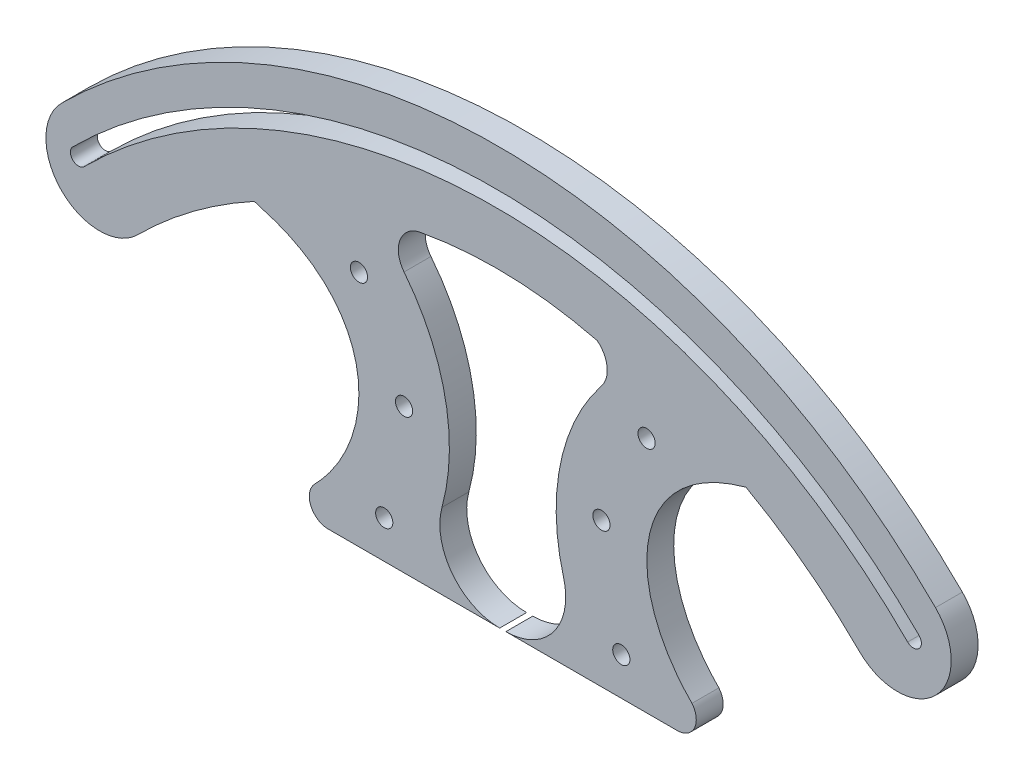
ISO-10303-21;
HEADER;
FILE_DESCRIPTION(('STEP AP214'),'2;1');
FILE_NAME('part.step','',(''),(''),'','','');
FILE_SCHEMA(('AUTOMOTIVE_DESIGN { 1 0 10303 214 1 1 1 1 }'));
ENDSEC;
DATA;
#1=APPLICATION_CONTEXT('core data for automotive mechanical design processes');
#2=APPLICATION_PROTOCOL_DEFINITION('international standard','automotive_design',2000,#1);
#3=PRODUCT_CONTEXT('',#1,'mechanical');
#4=PRODUCT('Part','Part','',(#3));
#5=PRODUCT_RELATED_PRODUCT_CATEGORY('part','',(#4));
#6=PRODUCT_DEFINITION_FORMATION('','',#4);
#7=PRODUCT_DEFINITION_CONTEXT('part definition',#1,'design');
#8=PRODUCT_DEFINITION('design','',#6,#7);
#9=PRODUCT_DEFINITION_SHAPE('','',#8);
#10=(LENGTH_UNIT() NAMED_UNIT(*) SI_UNIT(.MILLI.,.METRE.));
#11=(NAMED_UNIT(*) PLANE_ANGLE_UNIT() SI_UNIT($,.RADIAN.));
#12=(NAMED_UNIT(*) SI_UNIT($,.STERADIAN.) SOLID_ANGLE_UNIT());
#13=UNCERTAINTY_MEASURE_WITH_UNIT(LENGTH_MEASURE(1.E-05),#10,'distance_accuracy_value','');
#14=(GEOMETRIC_REPRESENTATION_CONTEXT(3) GLOBAL_UNCERTAINTY_ASSIGNED_CONTEXT((#13)) GLOBAL_UNIT_ASSIGNED_CONTEXT((#10,
#11,#12)) REPRESENTATION_CONTEXT('',''));
#15=CARTESIAN_POINT('',(0.,0.,0.));
#16=DIRECTION('',(0.,0.,1.));
#17=DIRECTION('',(1.,0.,0.));
#18=AXIS2_PLACEMENT_3D('',#15,#16,#17);
#19=CARTESIAN_POINT('',(-78.941928064493,66.2145491766591,5.));
#20=DIRECTION('',(0.,0.,-1.));
#21=DIRECTION('',(-1.,0.,0.));
#22=AXIS2_PLACEMENT_3D('',#19,#20,#21);
#23=CYLINDRICAL_SURFACE('',#22,1.49999999999999);
#24=CARTESIAN_POINT('',(-78.941928064493,66.2145491766591,0.));
#25=DIRECTION('',(0.,0.,1.));
#26=DIRECTION('',(1.,0.,0.));
#27=AXIS2_PLACEMENT_3D('',#24,#25,#26);
#28=CIRCLE('',#27,1.49999999999999);
#29=CARTESIAN_POINT('',(-80.0025882362729,67.2752093484389,0.));
#30=VERTEX_POINT('',#29);
#31=CARTESIAN_POINT('',(-77.8812678927132,65.1538890048793,0.));
#32=VERTEX_POINT('',#31);
#33=EDGE_CURVE('E302',#30,#32,#28,.T.);
#34=ORIENTED_EDGE('',*,*,#33,.F.);
#35=DIRECTION('',(0.,0.,-1.));
#36=VECTOR('',#35,1.);
#37=CARTESIAN_POINT('',(-80.0025882362729,67.2752093484389,5.));
#38=LINE('',#37,#36);
#39=CARTESIAN_POINT('',(-80.0025882362729,67.2752093484389,5.));
#40=VERTEX_POINT('',#39);
#41=EDGE_CURVE('E11',#40,#30,#38,.T.);
#42=ORIENTED_EDGE('',*,*,#41,.F.);
#43=CARTESIAN_POINT('',(-78.941928064493,66.2145491766591,5.));
#44=DIRECTION('',(0.,0.,1.));
#45=DIRECTION('',(1.,0.,0.));
#46=AXIS2_PLACEMENT_3D('',#43,#44,#45);
#47=CIRCLE('',#46,1.49999999999999);
#48=CARTESIAN_POINT('',(-77.8812678927132,65.1538890048793,5.));
#49=VERTEX_POINT('',#48);
#50=EDGE_CURVE('E214',#40,#49,#47,.T.);
#51=ORIENTED_EDGE('',*,*,#50,.T.);
#52=DIRECTION('',(0.,0.,-1.));
#53=VECTOR('',#52,1.);
#54=CARTESIAN_POINT('',(-77.8812678927132,65.1538890048793,5.));
#55=LINE('',#54,#53);
#56=EDGE_CURVE('E133',#49,#32,#55,.T.);
#57=ORIENTED_EDGE('',*,*,#56,.T.);
#58=EDGE_LOOP('',(#34,#42,#51,#57));
#59=FACE_BOUND('',#58,.T.);
#60=ADVANCED_FACE('F35',(#59),#23,.F.);
#61=CARTESIAN_POINT('',(-1.2789137930092,-11.4484650948247,5.));
#62=DIRECTION('',(0.,0.,-1.));
#63=DIRECTION('',(-1.,0.,0.));
#64=AXIS2_PLACEMENT_3D('',#61,#62,#63);
#65=CYLINDRICAL_SURFACE('',#64,111.332088077508);
#66=CARTESIAN_POINT('',(-1.2789137930092,-11.4484650948247,0.));
#67=DIRECTION('',(0.,0.,1.));
#68=DIRECTION('',(1.,0.,0.));
#69=AXIS2_PLACEMENT_3D('',#66,#67,#68);
#70=CIRCLE('',#69,111.332088077508);
#71=CARTESIAN_POINT('',(77.4447606502544,67.2752093484389,0.));
#72=VERTEX_POINT('',#71);
#73=EDGE_CURVE('E205',#72,#30,#70,.T.);
#74=ORIENTED_EDGE('',*,*,#73,.F.);
#75=DIRECTION('',(0.,0.,-1.));
#76=VECTOR('',#75,1.);
#77=CARTESIAN_POINT('',(77.4447606502544,67.2752093484389,5.));
#78=LINE('',#77,#76);
#79=CARTESIAN_POINT('',(77.4447606502544,67.2752093484389,5.));
#80=VERTEX_POINT('',#79);
#81=EDGE_CURVE('E45',#80,#72,#78,.T.);
#82=ORIENTED_EDGE('',*,*,#81,.F.);
#83=CARTESIAN_POINT('',(-1.2789137930092,-11.4484650948247,5.));
#84=DIRECTION('',(0.,0.,1.));
#85=DIRECTION('',(1.,0.,0.));
#86=AXIS2_PLACEMENT_3D('',#83,#84,#85);
#87=CIRCLE('',#86,111.332088077508);
#88=EDGE_CURVE('E203',#80,#40,#87,.T.);
#89=ORIENTED_EDGE('',*,*,#88,.T.);
#90=ORIENTED_EDGE('',*,*,#41,.T.);
#91=EDGE_LOOP('',(#74,#82,#89,#90));
#92=FACE_BOUND('',#91,.T.);
#93=ADVANCED_FACE('F202',(#92),#65,.F.);
#94=CARTESIAN_POINT('',(76.3841004784746,66.2145491766591,5.));
#95=DIRECTION('',(0.,0.,-1.));
#96=DIRECTION('',(-1.,0.,0.));
#97=AXIS2_PLACEMENT_3D('',#94,#95,#96);
#98=CYLINDRICAL_SURFACE('',#97,1.5);
#99=CARTESIAN_POINT('',(76.3841004784746,66.2145491766591,0.));
#100=DIRECTION('',(0.,0.,1.));
#101=DIRECTION('',(1.,0.,0.));
#102=AXIS2_PLACEMENT_3D('',#99,#100,#101);
#103=CIRCLE('',#102,1.5);
#104=CARTESIAN_POINT('',(75.3234403066948,65.1538890048793,0.));
#105=VERTEX_POINT('',#104);
#106=EDGE_CURVE('E306',#105,#72,#103,.T.);
#107=ORIENTED_EDGE('',*,*,#106,.F.);
#108=DIRECTION('',(0.,0.,-1.));
#109=VECTOR('',#108,1.);
#110=CARTESIAN_POINT('',(75.3234403066948,65.1538890048793,5.));
#111=LINE('',#110,#109);
#112=CARTESIAN_POINT('',(75.3234403066948,65.1538890048793,5.));
#113=VERTEX_POINT('',#112);
#114=EDGE_CURVE('E126',#113,#105,#111,.T.);
#115=ORIENTED_EDGE('',*,*,#114,.F.);
#116=CARTESIAN_POINT('',(76.3841004784746,66.2145491766591,5.));
#117=DIRECTION('',(0.,0.,1.));
#118=DIRECTION('',(1.,0.,0.));
#119=AXIS2_PLACEMENT_3D('',#116,#117,#118);
#120=CIRCLE('',#119,1.5);
#121=EDGE_CURVE('E213',#113,#80,#120,.T.);
#122=ORIENTED_EDGE('',*,*,#121,.T.);
#123=ORIENTED_EDGE('',*,*,#81,.T.);
#124=EDGE_LOOP('',(#107,#115,#122,#123));
#125=FACE_BOUND('',#124,.T.);
#126=ADVANCED_FACE('F216',(#125),#98,.F.);
#127=CARTESIAN_POINT('',(17.549793049826,55.0367014000985,5.));
#128=DIRECTION('',(-0.303802750093949,-0.952734952143225,0.));
#129=DIRECTION('',(0.952734952143225,-0.303802750093949,0.));
#130=AXIS2_PLACEMENT_3D('',#127,#128,#129);
#131=PLANE('',#130);
#132=DIRECTION('',(-0.952734952143225,0.303802750093949,0.));
#133=VECTOR('',#132,1.);
#134=CARTESIAN_POINT('',(17.549793049826,55.0367014000985,0.));
#135=LINE('',#134,#133);
#136=CARTESIAN_POINT('',(-45.0557374475651,75.,0.));
#137=VERTEX_POINT('',#136);
#138=CARTESIAN_POINT('',(-46.2299272100906,75.3744190114836,0.));
#139=VERTEX_POINT('',#138);
#140=EDGE_CURVE('E240',#137,#139,#135,.T.);
#141=ORIENTED_EDGE('',*,*,#140,.F.);
#142=DIRECTION('',(0.,0.,-1.));
#143=VECTOR('',#142,1.);
#144=CARTESIAN_POINT('',(-45.0557374475651,75.,5.));
#145=LINE('',#144,#143);
#146=CARTESIAN_POINT('',(-45.0557374475651,75.,5.));
#147=VERTEX_POINT('',#146);
#148=EDGE_CURVE('E39',#147,#137,#145,.T.);
#149=ORIENTED_EDGE('',*,*,#148,.F.);
#150=DIRECTION('',(-0.952734952143225,0.303802750093949,0.));
#151=VECTOR('',#150,1.);
#152=CARTESIAN_POINT('',(17.549793049826,55.0367014000985,5.));
#153=LINE('',#152,#151);
#154=CARTESIAN_POINT('',(-46.2299272100906,75.3744190114836,5.));
#155=VERTEX_POINT('',#154);
#156=EDGE_CURVE('E328',#147,#155,#153,.T.);
#157=ORIENTED_EDGE('',*,*,#156,.T.);
#158=DIRECTION('',(0.,0.,-1.));
#159=VECTOR('',#158,1.);
#160=CARTESIAN_POINT('',(-46.2299272100906,75.3744190114836,5.));
#161=LINE('',#160,#159);
#162=EDGE_CURVE('E239',#155,#139,#161,.T.);
#163=ORIENTED_EDGE('',*,*,#162,.T.);
#164=EDGE_LOOP('',(#141,#149,#157,#163));
#165=FACE_BOUND('',#164,.T.);
#166=ADVANCED_FACE('F37',(#165),#131,.T.);
#167=CARTESIAN_POINT('',(-45.0557374475651,75.,5.));
#168=CARTESIAN_POINT('',(-29.9457482812626,70.8924992288879,5.));
#169=CARTESIAN_POINT('',(-22.5994925533222,54.7742296366952,5.));
#170=CARTESIAN_POINT('',(-31.1258499826614,39.4112712545638,5.));
#171=CARTESIAN_POINT('',(-35.0019822048694,35.4282458126308,5.));
#172=B_SPLINE_CURVE_WITH_KNOTS('',3,(#167,#168,#169,#170,#171),.UNSPECIFIED.,.F.,.F.,(4,1,4),
(0.154808761441348,0.468621414690025,0.606167070491541),.UNSPECIFIED.);
#173=DIRECTION('',(0.,0.,-1.));
#174=VECTOR('',#173,1.);
#175=SURFACE_OF_LINEAR_EXTRUSION('',#172,#174);
#176=CARTESIAN_POINT('',(-45.0557374475651,75.,0.));
#177=CARTESIAN_POINT('',(-29.9457482812626,70.8924992288879,0.));
#178=CARTESIAN_POINT('',(-22.5994925533222,54.7742296366952,0.));
#179=CARTESIAN_POINT('',(-31.1258499826614,39.4112712545638,0.));
#180=CARTESIAN_POINT('',(-35.0019822048694,35.4282458126308,0.));
#181=B_SPLINE_CURVE_WITH_KNOTS('',3,(#176,#177,#178,#179,#180),.UNSPECIFIED.,.F.,.F.,(4,1,4),
(0.154808761441348,0.468621414690025,0.606167070491541),.UNSPECIFIED.);
#182=CARTESIAN_POINT('',(-35.0019822048694,35.4282458126308,0.));
#183=VERTEX_POINT('',#182);
#184=EDGE_CURVE('E243',#137,#183,#181,.T.);
#185=ORIENTED_EDGE('',*,*,#184,.T.);
#186=DIRECTION('',(0.,0.,-1.));
#187=VECTOR('',#186,1.);
#188=CARTESIAN_POINT('',(-35.0019822048694,35.4282458126308,5.));
#189=LINE('',#188,#187);
#190=CARTESIAN_POINT('',(-35.0019822048694,35.4282458126308,5.));
#191=VERTEX_POINT('',#190);
#192=EDGE_CURVE('E368',#191,#183,#189,.T.);
#193=ORIENTED_EDGE('',*,*,#192,.F.);
#194=EDGE_CURVE('E376',#147,#191,#172,.T.);
#195=ORIENTED_EDGE('',*,*,#194,.F.);
#196=ORIENTED_EDGE('',*,*,#148,.T.);
#197=EDGE_LOOP('',(#185,#193,#195,#196));
#198=FACE_BOUND('',#197,.T.);
#199=ADVANCED_FACE('F375',(#198),#175,.F.);
#200=CARTESIAN_POINT('',(-32.4790033651743,32.9729766412289,5.));
#201=DIRECTION('',(0.,0.,-1.));
#202=DIRECTION('',(-1.,0.,0.));
#203=AXIS2_PLACEMENT_3D('',#200,#201,#202);
#204=CYLINDRICAL_SURFACE('',#203,3.52047850861017);
#205=CARTESIAN_POINT('',(-32.4790033651743,32.9729766412289,0.));
#206=DIRECTION('',(0.,0.,1.));
#207=DIRECTION('',(1.,0.,0.));
#208=AXIS2_PLACEMENT_3D('',#205,#206,#207);
#209=CIRCLE('',#208,3.52047850861017);
#210=CARTESIAN_POINT('',(-32.4790033651742,29.4524981326187,0.));
#211=VERTEX_POINT('',#210);
#212=EDGE_CURVE('E248',#211,#183,#209,.F.);
#213=ORIENTED_EDGE('',*,*,#212,.F.);
#214=DIRECTION('',(0.,0.,-1.));
#215=VECTOR('',#214,1.);
#216=CARTESIAN_POINT('',(-32.4790033651742,29.4524981326187,5.));
#217=LINE('',#216,#215);
#218=CARTESIAN_POINT('',(-32.4790033651742,29.4524981326187,5.));
#219=VERTEX_POINT('',#218);
#220=EDGE_CURVE('E367',#219,#211,#217,.T.);
#221=ORIENTED_EDGE('',*,*,#220,.F.);
#222=CARTESIAN_POINT('',(-32.4790033651743,32.9729766412289,5.));
#223=DIRECTION('',(0.,0.,1.));
#224=DIRECTION('',(1.,0.,0.));
#225=AXIS2_PLACEMENT_3D('',#222,#223,#224);
#226=CIRCLE('',#225,3.52047850861017);
#227=EDGE_CURVE('E748',#219,#191,#226,.F.);
#228=ORIENTED_EDGE('',*,*,#227,.T.);
#229=ORIENTED_EDGE('',*,*,#192,.T.);
#230=EDGE_LOOP('',(#213,#221,#228,#229));
#231=FACE_BOUND('',#230,.T.);
#232=ADVANCED_FACE('F476',(#231),#204,.T.);
#233=CARTESIAN_POINT('',(0.,29.4524981326187,5.));
#234=DIRECTION('',(0.,-1.,0.));
#235=DIRECTION('',(1.,0.,0.));
#236=AXIS2_PLACEMENT_3D('',#233,#234,#235);
#237=PLANE('',#236);
#238=DIRECTION('',(-1.,0.,0.));
#239=VECTOR('',#238,1.);
#240=CARTESIAN_POINT('',(0.,29.4524981326187,0.));
#241=LINE('',#240,#239);
#242=CARTESIAN_POINT('',(-0.573242193932219,29.4524981326187,0.));
#243=VERTEX_POINT('',#242);
#244=EDGE_CURVE('E254',#243,#211,#241,.T.);
#245=ORIENTED_EDGE('',*,*,#244,.F.);
#246=DIRECTION('',(0.,0.,-1.));
#247=VECTOR('',#246,1.);
#248=CARTESIAN_POINT('',(-0.573242193932219,29.4524981326187,5.));
#249=LINE('',#248,#247);
#250=CARTESIAN_POINT('',(-0.573242193932219,29.4524981326187,5.));
#251=VERTEX_POINT('',#250);
#252=EDGE_CURVE('E365',#251,#243,#249,.T.);
#253=ORIENTED_EDGE('',*,*,#252,.F.);
#254=DIRECTION('',(-1.,0.,0.));
#255=VECTOR('',#254,1.);
#256=CARTESIAN_POINT('',(0.,29.4524981326187,5.));
#257=LINE('',#256,#255);
#258=EDGE_CURVE('E474',#251,#219,#257,.T.);
#259=ORIENTED_EDGE('',*,*,#258,.T.);
#260=ORIENTED_EDGE('',*,*,#220,.T.);
#261=EDGE_LOOP('',(#245,#253,#259,#260));
#262=FACE_BOUND('',#261,.T.);
#263=ADVANCED_FACE('F472',(#262),#237,.T.);
#264=CARTESIAN_POINT('',(-0.573242193932219,40.5887460175978,5.));
#265=DIRECTION('',(0.,0.,-1.));
#266=DIRECTION('',(-1.,0.,0.));
#267=AXIS2_PLACEMENT_3D('',#264,#265,#266);
#268=CYLINDRICAL_SURFACE('',#267,11.1362478849791);
#269=CARTESIAN_POINT('',(-0.573242193932219,40.5887460175978,0.));
#270=DIRECTION('',(0.,0.,1.));
#271=DIRECTION('',(1.,0.,0.));
#272=AXIS2_PLACEMENT_3D('',#269,#270,#271);
#273=CIRCLE('',#272,11.1362478849791);
#274=CARTESIAN_POINT('',(-11.3130557503206,43.5336435930185,0.));
#275=VERTEX_POINT('',#274);
#276=EDGE_CURVE('E257',#243,#275,#273,.F.);
#277=ORIENTED_EDGE('',*,*,#276,.T.);
#278=DIRECTION('',(0.,0.,-1.));
#279=VECTOR('',#278,1.);
#280=CARTESIAN_POINT('',(-11.3130557503206,43.5336435930185,5.));
#281=LINE('',#280,#279);
#282=CARTESIAN_POINT('',(-11.3130557503206,43.5336435930185,5.));
#283=VERTEX_POINT('',#282);
#284=EDGE_CURVE('E362',#283,#275,#281,.T.);
#285=ORIENTED_EDGE('',*,*,#284,.F.);
#286=CARTESIAN_POINT('',(-0.573242193932219,40.5887460175978,5.));
#287=DIRECTION('',(0.,0.,1.));
#288=DIRECTION('',(1.,0.,0.));
#289=AXIS2_PLACEMENT_3D('',#286,#287,#288);
#290=CIRCLE('',#289,11.1362478849791);
#291=EDGE_CURVE('E468',#251,#283,#290,.F.);
#292=ORIENTED_EDGE('',*,*,#291,.F.);
#293=ORIENTED_EDGE('',*,*,#252,.T.);
#294=EDGE_LOOP('',(#277,#285,#292,#293));
#295=FACE_BOUND('',#294,.T.);
#296=ADVANCED_FACE('F467',(#295),#268,.F.);
#297=CARTESIAN_POINT('',(-48.7100144691619,53.7880313885788,5.));
#298=DIRECTION('',(0.,0.,-1.));
#299=DIRECTION('',(-1.,0.,0.));
#300=AXIS2_PLACEMENT_3D('',#297,#298,#299);
#301=CYLINDRICAL_SURFACE('',#300,38.7773773027581);
#302=CARTESIAN_POINT('',(-48.7100144691619,53.7880313885788,0.));
#303=DIRECTION('',(0.,0.,1.));
#304=DIRECTION('',(1.,0.,0.));
#305=AXIS2_PLACEMENT_3D('',#302,#303,#304);
#306=CIRCLE('',#305,38.7773773027581);
#307=CARTESIAN_POINT('',(-18.3640575271982,77.9294457580176,0.));
#308=VERTEX_POINT('',#307);
#309=EDGE_CURVE('E259',#275,#308,#306,.T.);
#310=ORIENTED_EDGE('',*,*,#309,.T.);
#311=DIRECTION('',(0.,0.,-1.));
#312=VECTOR('',#311,1.);
#313=CARTESIAN_POINT('',(-18.3640575271982,77.9294457580176,5.));
#314=LINE('',#313,#312);
#315=CARTESIAN_POINT('',(-18.3640575271982,77.9294457580176,5.));
#316=VERTEX_POINT('',#315);
#317=EDGE_CURVE('E360',#316,#308,#314,.T.);
#318=ORIENTED_EDGE('',*,*,#317,.F.);
#319=CARTESIAN_POINT('',(-48.7100144691619,53.7880313885788,5.));
#320=DIRECTION('',(0.,0.,1.));
#321=DIRECTION('',(1.,0.,0.));
#322=AXIS2_PLACEMENT_3D('',#319,#320,#321);
#323=CIRCLE('',#322,38.7773773027581);
#324=EDGE_CURVE('E464',#283,#316,#323,.T.);
#325=ORIENTED_EDGE('',*,*,#324,.F.);
#326=ORIENTED_EDGE('',*,*,#284,.T.);
#327=EDGE_LOOP('',(#310,#318,#325,#326));
#328=FACE_BOUND('',#327,.T.);
#329=ADVANCED_FACE('F462',(#328),#301,.T.);
#330=CARTESIAN_POINT('',(-14.5190064202318,80.9883366746057,5.));
#331=DIRECTION('',(0.,0.,-1.));
#332=DIRECTION('',(-1.,0.,0.));
#333=AXIS2_PLACEMENT_3D('',#330,#331,#332);
#334=CYLINDRICAL_SURFACE('',#333,4.91337273721105);
#335=CARTESIAN_POINT('',(-14.5190064202318,80.9883366746057,0.));
#336=DIRECTION('',(0.,0.,1.));
#337=DIRECTION('',(1.,0.,0.));
#338=AXIS2_PLACEMENT_3D('',#335,#336,#337);
#339=CIRCLE('',#338,4.91337273721105);
#340=CARTESIAN_POINT('',(-15.2684143703002,85.8442216999273,0.));
#341=VERTEX_POINT('',#340);
#342=EDGE_CURVE('E262',#341,#308,#339,.T.);
#343=ORIENTED_EDGE('',*,*,#342,.F.);
#344=DIRECTION('',(0.,0.,-1.));
#345=VECTOR('',#344,1.);
#346=CARTESIAN_POINT('',(-15.2684143703002,85.8442216999273,5.));
#347=LINE('',#346,#345);
#348=CARTESIAN_POINT('',(-15.2684143703002,85.8442216999273,5.));
#349=VERTEX_POINT('',#348);
#350=EDGE_CURVE('E358',#349,#341,#347,.T.);
#351=ORIENTED_EDGE('',*,*,#350,.F.);
#352=CARTESIAN_POINT('',(-14.5190064202318,80.9883366746057,5.));
#353=DIRECTION('',(0.,0.,1.));
#354=DIRECTION('',(1.,0.,0.));
#355=AXIS2_PLACEMENT_3D('',#352,#353,#354);
#356=CIRCLE('',#355,4.91337273721105);
#357=EDGE_CURVE('E459',#349,#316,#356,.T.);
#358=ORIENTED_EDGE('',*,*,#357,.T.);
#359=ORIENTED_EDGE('',*,*,#317,.T.);
#360=EDGE_LOOP('',(#343,#351,#358,#359));
#361=FACE_BOUND('',#360,.T.);
#362=ADVANCED_FACE('F455',(#361),#334,.F.);
#363=CARTESIAN_POINT('',(-1.15465798018424,9.62516806624939,5.));
#364=DIRECTION('',(0.,0.,-1.));
#365=DIRECTION('',(-1.,0.,0.));
#366=AXIS2_PLACEMENT_3D('',#363,#364,#365);
#367=CYLINDRICAL_SURFACE('',#366,77.5147873392749);
#368=CARTESIAN_POINT('',(-1.15465798018424,9.62516806624939,0.));
#369=DIRECTION('',(0.,0.,1.));
#370=DIRECTION('',(1.,0.,0.));
#371=AXIS2_PLACEMENT_3D('',#368,#369,#370);
#372=CIRCLE('',#371,77.5147873392749);
#373=CARTESIAN_POINT('',(17.5612829912327,84.8465467415133,0.));
#374=VERTEX_POINT('',#373);
#375=EDGE_CURVE('E265',#374,#341,#372,.T.);
#376=ORIENTED_EDGE('',*,*,#375,.F.);
#377=DIRECTION('',(0.,0.,-1.));
#378=VECTOR('',#377,1.);
#379=CARTESIAN_POINT('',(17.5612829912327,84.8465467415133,5.));
#380=LINE('',#379,#378);
#381=CARTESIAN_POINT('',(17.5612829912327,84.8465467415133,5.));
#382=VERTEX_POINT('',#381);
#383=EDGE_CURVE('E356',#382,#374,#380,.T.);
#384=ORIENTED_EDGE('',*,*,#383,.F.);
#385=CARTESIAN_POINT('',(-1.15465798018424,9.62516806624939,5.));
#386=DIRECTION('',(0.,0.,1.));
#387=DIRECTION('',(1.,0.,0.));
#388=AXIS2_PLACEMENT_3D('',#385,#386,#387);
#389=CIRCLE('',#388,77.5147873392749);
#390=EDGE_CURVE('E450',#382,#349,#389,.T.);
#391=ORIENTED_EDGE('',*,*,#390,.T.);
#392=ORIENTED_EDGE('',*,*,#350,.T.);
#393=EDGE_LOOP('',(#376,#384,#391,#392));
#394=FACE_BOUND('',#393,.T.);
#395=ADVANCED_FACE('F449',(#394),#367,.F.);
#396=CARTESIAN_POINT('',(14.5190064202449,80.9883366746057,5.));
#397=DIRECTION('',(0.,0.,-1.));
#398=DIRECTION('',(-1.,0.,0.));
#399=AXIS2_PLACEMENT_3D('',#396,#397,#398);
#400=CYLINDRICAL_SURFACE('',#399,4.91337273721105);
#401=CARTESIAN_POINT('',(14.5190064202449,80.9883366746057,0.));
#402=DIRECTION('',(0.,0.,1.));
#403=DIRECTION('',(1.,0.,0.));
#404=AXIS2_PLACEMENT_3D('',#401,#402,#403);
#405=CIRCLE('',#404,4.91337273721105);
#406=CARTESIAN_POINT('',(18.3640575272114,77.9294457580176,0.));
#407=VERTEX_POINT('',#406);
#408=EDGE_CURVE('E268',#374,#407,#405,.F.);
#409=ORIENTED_EDGE('',*,*,#408,.T.);
#410=DIRECTION('',(0.,0.,-1.));
#411=VECTOR('',#410,1.);
#412=CARTESIAN_POINT('',(18.3640575272114,77.9294457580176,5.));
#413=LINE('',#412,#411);
#414=CARTESIAN_POINT('',(18.3640575272114,77.9294457580176,5.));
#415=VERTEX_POINT('',#414);
#416=EDGE_CURVE('E354',#415,#407,#413,.T.);
#417=ORIENTED_EDGE('',*,*,#416,.F.);
#418=CARTESIAN_POINT('',(14.5190064202449,80.9883366746057,5.));
#419=DIRECTION('',(0.,0.,1.));
#420=DIRECTION('',(1.,0.,0.));
#421=AXIS2_PLACEMENT_3D('',#418,#419,#420);
#422=CIRCLE('',#421,4.91337273721105);
#423=EDGE_CURVE('E445',#382,#415,#422,.F.);
#424=ORIENTED_EDGE('',*,*,#423,.F.);
#425=ORIENTED_EDGE('',*,*,#383,.T.);
#426=EDGE_LOOP('',(#409,#417,#424,#425));
#427=FACE_BOUND('',#426,.T.);
#428=ADVANCED_FACE('F444',(#427),#400,.F.);
#429=CARTESIAN_POINT('',(48.710014469175,53.7880313885788,5.));
#430=DIRECTION('',(0.,0.,-1.));
#431=DIRECTION('',(-1.,0.,0.));
#432=AXIS2_PLACEMENT_3D('',#429,#430,#431);
#433=CYLINDRICAL_SURFACE('',#432,38.7773773027581);
#434=CARTESIAN_POINT('',(48.710014469175,53.7880313885788,0.));
#435=DIRECTION('',(0.,0.,1.));
#436=DIRECTION('',(1.,0.,0.));
#437=AXIS2_PLACEMENT_3D('',#434,#435,#436);
#438=CIRCLE('',#437,38.7773773027581);
#439=CARTESIAN_POINT('',(11.3130557503337,43.5336435930185,0.));
#440=VERTEX_POINT('',#439);
#441=EDGE_CURVE('E271',#440,#407,#438,.F.);
#442=ORIENTED_EDGE('',*,*,#441,.F.);
#443=DIRECTION('',(0.,0.,-1.));
#444=VECTOR('',#443,1.);
#445=CARTESIAN_POINT('',(11.3130557503337,43.5336435930185,5.));
#446=LINE('',#445,#444);
#447=CARTESIAN_POINT('',(11.3130557503337,43.5336435930185,5.));
#448=VERTEX_POINT('',#447);
#449=EDGE_CURVE('E352',#448,#440,#446,.T.);
#450=ORIENTED_EDGE('',*,*,#449,.F.);
#451=CARTESIAN_POINT('',(48.710014469175,53.7880313885788,5.));
#452=DIRECTION('',(0.,0.,1.));
#453=DIRECTION('',(1.,0.,0.));
#454=AXIS2_PLACEMENT_3D('',#451,#452,#453);
#455=CIRCLE('',#454,38.7773773027581);
#456=EDGE_CURVE('E441',#448,#415,#455,.F.);
#457=ORIENTED_EDGE('',*,*,#456,.T.);
#458=ORIENTED_EDGE('',*,*,#416,.T.);
#459=EDGE_LOOP('',(#442,#450,#457,#458));
#460=FACE_BOUND('',#459,.T.);
#461=ADVANCED_FACE('F437',(#460),#433,.T.);
#462=CARTESIAN_POINT('',(0.573242193945353,40.5887460175979,5.));
#463=DIRECTION('',(0.,0.,-1.));
#464=DIRECTION('',(-1.,0.,0.));
#465=AXIS2_PLACEMENT_3D('',#462,#463,#464);
#466=CYLINDRICAL_SURFACE('',#465,11.1362478849791);
#467=CARTESIAN_POINT('',(0.573242193945353,40.5887460175979,0.));
#468=DIRECTION('',(0.,0.,1.));
#469=DIRECTION('',(1.,0.,0.));
#470=AXIS2_PLACEMENT_3D('',#467,#468,#469);
#471=CIRCLE('',#470,11.1362478849791);
#472=CARTESIAN_POINT('',(0.573242193945381,29.4524981326187,0.));
#473=VERTEX_POINT('',#472);
#474=EDGE_CURVE('E274',#473,#440,#471,.T.);
#475=ORIENTED_EDGE('',*,*,#474,.F.);
#476=DIRECTION('',(0.,0.,-1.));
#477=VECTOR('',#476,1.);
#478=CARTESIAN_POINT('',(0.573242193945381,29.4524981326187,5.));
#479=LINE('',#478,#477);
#480=CARTESIAN_POINT('',(0.573242193945381,29.4524981326187,5.));
#481=VERTEX_POINT('',#480);
#482=EDGE_CURVE('E350',#481,#473,#479,.T.);
#483=ORIENTED_EDGE('',*,*,#482,.F.);
#484=CARTESIAN_POINT('',(0.573242193945353,40.5887460175979,5.));
#485=DIRECTION('',(0.,0.,1.));
#486=DIRECTION('',(1.,0.,0.));
#487=AXIS2_PLACEMENT_3D('',#484,#485,#486);
#488=CIRCLE('',#487,11.1362478849791);
#489=EDGE_CURVE('E432',#481,#448,#488,.T.);
#490=ORIENTED_EDGE('',*,*,#489,.T.);
#491=ORIENTED_EDGE('',*,*,#449,.T.);
#492=EDGE_LOOP('',(#475,#483,#490,#491));
#493=FACE_BOUND('',#492,.T.);
#494=ADVANCED_FACE('F431',(#493),#466,.F.);
#495=CARTESIAN_POINT('',(0.,29.4524981326187,5.));
#496=DIRECTION('',(0.,1.,0.));
#497=DIRECTION('',(-1.,0.,0.));
#498=AXIS2_PLACEMENT_3D('',#495,#496,#497);
#499=PLANE('',#498);
#500=DIRECTION('',(1.,0.,0.));
#501=VECTOR('',#500,1.);
#502=CARTESIAN_POINT('',(0.,29.4524981326187,0.));
#503=LINE('',#502,#501);
#504=CARTESIAN_POINT('',(32.4790033651873,29.4524981326188,0.));
#505=VERTEX_POINT('',#504);
#506=EDGE_CURVE('E277',#473,#505,#503,.T.);
#507=ORIENTED_EDGE('',*,*,#506,.T.);
#508=DIRECTION('',(0.,0.,-1.));
#509=VECTOR('',#508,1.);
#510=CARTESIAN_POINT('',(32.4790033651873,29.4524981326188,5.));
#511=LINE('',#510,#509);
#512=CARTESIAN_POINT('',(32.4790033651873,29.4524981326188,5.));
#513=VERTEX_POINT('',#512);
#514=EDGE_CURVE('E347',#513,#505,#511,.T.);
#515=ORIENTED_EDGE('',*,*,#514,.F.);
#516=DIRECTION('',(1.,0.,0.));
#517=VECTOR('',#516,1.);
#518=CARTESIAN_POINT('',(0.,29.4524981326187,5.));
#519=LINE('',#518,#517);
#520=EDGE_CURVE('E427',#481,#513,#519,.T.);
#521=ORIENTED_EDGE('',*,*,#520,.F.);
#522=ORIENTED_EDGE('',*,*,#482,.T.);
#523=EDGE_LOOP('',(#507,#515,#521,#522));
#524=FACE_BOUND('',#523,.T.);
#525=ADVANCED_FACE('F426',(#524),#499,.F.);
#526=CARTESIAN_POINT('',(32.4790033651873,32.972976641229,5.));
#527=DIRECTION('',(0.,0.,-1.));
#528=DIRECTION('',(-1.,0.,0.));
#529=AXIS2_PLACEMENT_3D('',#526,#527,#528);
#530=CYLINDRICAL_SURFACE('',#529,3.52047850861017);
#531=CARTESIAN_POINT('',(32.4790033651873,32.972976641229,0.));
#532=DIRECTION('',(0.,0.,1.));
#533=DIRECTION('',(1.,0.,0.));
#534=AXIS2_PLACEMENT_3D('',#531,#532,#533);
#535=CIRCLE('',#534,3.52047850861017);
#536=CARTESIAN_POINT('',(35.1967247175278,35.2107790410442,0.));
#537=VERTEX_POINT('',#536);
#538=EDGE_CURVE('E279',#505,#537,#535,.T.);
#539=ORIENTED_EDGE('',*,*,#538,.T.);
#540=DIRECTION('',(0.,0.,-1.));
#541=VECTOR('',#540,1.);
#542=CARTESIAN_POINT('',(35.1967247175278,35.2107790410442,5.));
#543=LINE('',#542,#541);
#544=CARTESIAN_POINT('',(35.1967247175278,35.2107790410442,5.));
#545=VERTEX_POINT('',#544);
#546=EDGE_CURVE('E345',#545,#537,#543,.T.);
#547=ORIENTED_EDGE('',*,*,#546,.F.);
#548=CARTESIAN_POINT('',(32.4790033651873,32.972976641229,5.));
#549=DIRECTION('',(0.,0.,1.));
#550=DIRECTION('',(1.,0.,0.));
#551=AXIS2_PLACEMENT_3D('',#548,#549,#550);
#552=CIRCLE('',#551,3.52047850861017);
#553=EDGE_CURVE('E423',#513,#545,#552,.T.);
#554=ORIENTED_EDGE('',*,*,#553,.F.);
#555=ORIENTED_EDGE('',*,*,#514,.T.);
#556=EDGE_LOOP('',(#539,#547,#554,#555));
#557=FACE_BOUND('',#556,.T.);
#558=ADVANCED_FACE('F420',(#557),#530,.T.);
#559=CARTESIAN_POINT('',(45.2420515641973,75.0539776502703,5.));
#560=CARTESIAN_POINT('',(30.1320623978949,70.9464768791582,5.));
#561=CARTESIAN_POINT('',(22.5400885489823,54.6807031963261,5.));
#562=CARTESIAN_POINT('',(31.1995080730502,39.2379341379593,5.));
#563=CARTESIAN_POINT('',(35.1967247175278,35.2107790410442,5.));
#564=B_SPLINE_CURVE_WITH_KNOTS('',3,(#559,#560,#561,#562,#563),.UNSPECIFIED.,.F.,.F.,(4,1,4),
(0.15480876144135,0.468621414690025,0.608629264667389),.UNSPECIFIED.);
#565=DIRECTION('',(0.,0.,-1.));
#566=VECTOR('',#565,1.);
#567=SURFACE_OF_LINEAR_EXTRUSION('',#564,#566);
#568=CARTESIAN_POINT('',(45.2420515641973,75.0539776502703,0.));
#569=CARTESIAN_POINT('',(30.1320623978949,70.9464768791582,0.));
#570=CARTESIAN_POINT('',(22.5400885489823,54.6807031963261,0.));
#571=CARTESIAN_POINT('',(31.1995080730502,39.2379341379593,0.));
#572=CARTESIAN_POINT('',(35.1967247175278,35.2107790410442,0.));
#573=B_SPLINE_CURVE_WITH_KNOTS('',3,(#568,#569,#570,#571,#572),.UNSPECIFIED.,.F.,.F.,(4,1,4),
(0.15480876144135,0.468621414690025,0.608629264667389),.UNSPECIFIED.);
#574=CARTESIAN_POINT('',(45.2420515641973,75.0539776502703,0.));
#575=VERTEX_POINT('',#574);
#576=EDGE_CURVE('E282',#575,#537,#573,.T.);
#577=ORIENTED_EDGE('',*,*,#576,.F.);
#578=DIRECTION('',(0.,0.,-1.));
#579=VECTOR('',#578,1.);
#580=CARTESIAN_POINT('',(45.2420515641973,75.0539776502703,5.));
#581=LINE('',#580,#579);
#582=CARTESIAN_POINT('',(45.2420515641973,75.0539776502703,5.));
#583=VERTEX_POINT('',#582);
#584=EDGE_CURVE('E343',#583,#575,#581,.T.);
#585=ORIENTED_EDGE('',*,*,#584,.F.);
#586=EDGE_CURVE('E509',#583,#545,#564,.T.);
#587=ORIENTED_EDGE('',*,*,#586,.T.);
#588=ORIENTED_EDGE('',*,*,#546,.T.);
#589=EDGE_LOOP('',(#577,#585,#587,#588));
#590=FACE_BOUND('',#589,.T.);
#591=ADVANCED_FACE('F414',(#590),#567,.T.);
#592=CARTESIAN_POINT('',(-0.785450823351054,-8.,5.));
#593=DIRECTION('',(0.,0.,-1.));
#594=DIRECTION('',(-1.,0.,0.));
#595=AXIS2_PLACEMENT_3D('',#592,#593,#594);
#596=CYLINDRICAL_SURFACE('',#595,94.9552219710289);
#597=CARTESIAN_POINT('',(-0.785450823351054,-8.,0.));
#598=DIRECTION('',(0.,0.,1.));
#599=DIRECTION('',(1.,0.,0.));
#600=AXIS2_PLACEMENT_3D('',#597,#598,#599);
#601=CIRCLE('',#600,94.9552219710289);
#602=CARTESIAN_POINT('',(66.3580305414326,59.1434813647931,0.));
#603=VERTEX_POINT('',#602);
#604=EDGE_CURVE('E287',#603,#575,#601,.T.);
#605=ORIENTED_EDGE('',*,*,#604,.F.);
#606=DIRECTION('',(0.,0.,-1.));
#607=VECTOR('',#606,1.);
#608=CARTESIAN_POINT('',(66.3580305414326,59.1434813647931,5.));
#609=LINE('',#608,#607);
#610=CARTESIAN_POINT('',(66.3580305414326,59.1434813647931,5.));
#611=VERTEX_POINT('',#610);
#612=EDGE_CURVE('E341',#611,#603,#609,.T.);
#613=ORIENTED_EDGE('',*,*,#612,.F.);
#614=CARTESIAN_POINT('',(-0.785450823351054,-8.,5.));
#615=DIRECTION('',(0.,0.,1.));
#616=DIRECTION('',(1.,0.,0.));
#617=AXIS2_PLACEMENT_3D('',#614,#615,#616);
#618=CIRCLE('',#617,94.9552219710289);
#619=EDGE_CURVE('E410',#611,#583,#618,.T.);
#620=ORIENTED_EDGE('',*,*,#619,.T.);
#621=ORIENTED_EDGE('',*,*,#584,.T.);
#622=EDGE_LOOP('',(#605,#613,#620,#621));
#623=FACE_BOUND('',#622,.T.);
#624=ADVANCED_FACE('F407',(#623),#596,.F.);
#625=CARTESIAN_POINT('',(73.4290983532976,66.2145491766591,5.));
#626=DIRECTION('',(0.,0.,-1.));
#627=DIRECTION('',(-1.,0.,0.));
#628=AXIS2_PLACEMENT_3D('',#625,#626,#627);
#629=CYLINDRICAL_SURFACE('',#628,9.99999999999999);
#630=CARTESIAN_POINT('',(73.4290983532976,66.2145491766591,0.));
#631=DIRECTION('',(0.,0.,1.));
#632=DIRECTION('',(1.,0.,0.));
#633=AXIS2_PLACEMENT_3D('',#630,#631,#632);
#634=CIRCLE('',#633,9.99999999999999);
#635=CARTESIAN_POINT('',(80.5001661651625,73.2856169885251,0.));
#636=VERTEX_POINT('',#635);
#637=EDGE_CURVE('E293',#603,#636,#634,.T.);
#638=ORIENTED_EDGE('',*,*,#637,.T.);
#639=DIRECTION('',(0.,0.,-1.));
#640=VECTOR('',#639,1.);
#641=CARTESIAN_POINT('',(80.5001661651625,73.2856169885251,5.));
#642=LINE('',#641,#640);
#643=CARTESIAN_POINT('',(80.5001661651625,73.2856169885251,5.));
#644=VERTEX_POINT('',#643);
#645=EDGE_CURVE('E338',#644,#636,#642,.T.);
#646=ORIENTED_EDGE('',*,*,#645,.F.);
#647=CARTESIAN_POINT('',(73.4290983532976,66.2145491766591,5.));
#648=DIRECTION('',(0.,0.,1.));
#649=DIRECTION('',(1.,0.,0.));
#650=AXIS2_PLACEMENT_3D('',#647,#648,#649);
#651=CIRCLE('',#650,9.99999999999999);
#652=EDGE_CURVE('E403',#611,#644,#651,.T.);
#653=ORIENTED_EDGE('',*,*,#652,.F.);
#654=ORIENTED_EDGE('',*,*,#612,.T.);
#655=EDGE_LOOP('',(#638,#646,#653,#654));
#656=FACE_BOUND('',#655,.T.);
#657=ADVANCED_FACE('F402',(#656),#629,.T.);
#658=CARTESIAN_POINT('',(-0.785450823351054,-8.,5.));
#659=DIRECTION('',(0.,0.,-1.));
#660=DIRECTION('',(-1.,0.,0.));
#661=AXIS2_PLACEMENT_3D('',#658,#659,#660);
#662=CYLINDRICAL_SURFACE('',#661,114.955221971029);
#663=CARTESIAN_POINT('',(-0.785450823351054,-8.,0.));
#664=DIRECTION('',(0.,0.,1.));
#665=DIRECTION('',(1.,0.,0.));
#666=AXIS2_PLACEMENT_3D('',#663,#664,#665);
#667=CIRCLE('',#666,114.955221971029);
#668=CARTESIAN_POINT('',(-82.0710678118647,73.285616988525,0.));
#669=VERTEX_POINT('',#668);
#670=EDGE_CURVE('E295',#636,#669,#667,.T.);
#671=ORIENTED_EDGE('',*,*,#670,.T.);
#672=DIRECTION('',(0.,0.,-1.));
#673=VECTOR('',#672,1.);
#674=CARTESIAN_POINT('',(-82.0710678118647,73.285616988525,5.));
#675=LINE('',#674,#673);
#676=CARTESIAN_POINT('',(-82.0710678118647,73.285616988525,5.));
#677=VERTEX_POINT('',#676);
#678=EDGE_CURVE('E335',#677,#669,#675,.T.);
#679=ORIENTED_EDGE('',*,*,#678,.F.);
#680=CARTESIAN_POINT('',(-0.785450823351054,-8.,5.));
#681=DIRECTION('',(0.,0.,1.));
#682=DIRECTION('',(1.,0.,0.));
#683=AXIS2_PLACEMENT_3D('',#680,#681,#682);
#684=CIRCLE('',#683,114.955221971029);
#685=EDGE_CURVE('E398',#644,#677,#684,.T.);
#686=ORIENTED_EDGE('',*,*,#685,.F.);
#687=ORIENTED_EDGE('',*,*,#645,.T.);
#688=EDGE_LOOP('',(#671,#679,#686,#687));
#689=FACE_BOUND('',#688,.T.);
#690=ADVANCED_FACE('F397',(#689),#662,.T.);
#691=CARTESIAN_POINT('',(-74.9999999999997,66.2145491766591,5.));
#692=DIRECTION('',(0.,0.,-1.));
#693=DIRECTION('',(-1.,0.,0.));
#694=AXIS2_PLACEMENT_3D('',#691,#692,#693);
#695=CYLINDRICAL_SURFACE('',#694,9.99999999999998);
#696=CARTESIAN_POINT('',(-74.9999999999997,66.2145491766591,0.));
#697=DIRECTION('',(0.,0.,1.));
#698=DIRECTION('',(1.,0.,0.));
#699=AXIS2_PLACEMENT_3D('',#696,#697,#698);
#700=CIRCLE('',#699,9.99999999999998);
#701=CARTESIAN_POINT('',(-67.9289320805857,59.1434814723421,0.));
#702=VERTEX_POINT('',#701);
#703=EDGE_CURVE('E297',#669,#702,#700,.T.);
#704=ORIENTED_EDGE('',*,*,#703,.T.);
#705=DIRECTION('',(0.,0.,-1.));
#706=VECTOR('',#705,1.);
#707=CARTESIAN_POINT('',(-67.9289320805857,59.1434814723421,5.));
#708=LINE('',#707,#706);
#709=CARTESIAN_POINT('',(-67.9289320805857,59.1434814723421,5.));
#710=VERTEX_POINT('',#709);
#711=EDGE_CURVE('E332',#710,#702,#708,.T.);
#712=ORIENTED_EDGE('',*,*,#711,.F.);
#713=CARTESIAN_POINT('',(-74.9999999999997,66.2145491766591,5.));
#714=DIRECTION('',(0.,0.,1.));
#715=DIRECTION('',(1.,0.,0.));
#716=AXIS2_PLACEMENT_3D('',#713,#714,#715);
#717=CIRCLE('',#716,9.99999999999998);
#718=EDGE_CURVE('E394',#677,#710,#717,.T.);
#719=ORIENTED_EDGE('',*,*,#718,.F.);
#720=ORIENTED_EDGE('',*,*,#678,.T.);
#721=EDGE_LOOP('',(#704,#712,#719,#720));
#722=FACE_BOUND('',#721,.T.);
#723=ADVANCED_FACE('F391',(#722),#695,.T.);
#724=CARTESIAN_POINT('',(22.0529249115015,36.4832960041538,5.));
#725=DIRECTION('',(0.,0.,-1.));
#726=DIRECTION('',(-1.,0.,0.));
#727=AXIS2_PLACEMENT_3D('',#724,#725,#726);
#728=CYLINDRICAL_SURFACE('',#727,1.60000000001253);
#729=CARTESIAN_POINT('',(22.0529249115015,36.4832960041538,5.));
#730=DIRECTION('',(0.,0.,1.));
#731=DIRECTION('',(1.,0.,0.));
#732=AXIS2_PLACEMENT_3D('',#729,#730,#731);
#733=CIRCLE('',#732,1.60000000001253);
#734=CARTESIAN_POINT('',(23.652924911514,36.4832960041538,5.));
#735=VERTEX_POINT('',#734);
#736=EDGE_CURVE('E233',#735,#735,#733,.F.);
#737=ORIENTED_EDGE('',*,*,#736,.F.);
#738=EDGE_LOOP('',(#737));
#739=FACE_BOUND('',#738,.T.);
#740=CARTESIAN_POINT('',(22.0529249115015,36.4832960041538,0.));
#741=DIRECTION('',(0.,0.,1.));
#742=DIRECTION('',(1.,0.,0.));
#743=AXIS2_PLACEMENT_3D('',#740,#741,#742);
#744=CIRCLE('',#743,1.60000000001253);
#745=CARTESIAN_POINT('',(23.652924911514,36.4832960041538,0.));
#746=VERTEX_POINT('',#745);
#747=EDGE_CURVE('E322',#746,#746,#744,.F.);
#748=ORIENTED_EDGE('',*,*,#747,.T.);
#749=EDGE_LOOP('',(#748));
#750=FACE_BOUND('',#749,.T.);
#751=ADVANCED_FACE('F498',(#739,#750),#728,.F.);
#752=CARTESIAN_POINT('',(-22.0529249114884,36.4832960041538,5.));
#753=DIRECTION('',(0.,0.,-1.));
#754=DIRECTION('',(-1.,0.,0.));
#755=AXIS2_PLACEMENT_3D('',#752,#753,#754);
#756=CYLINDRICAL_SURFACE('',#755,1.6);
#757=CARTESIAN_POINT('',(-22.0529249114884,36.4832960041538,5.));
#758=DIRECTION('',(0.,0.,1.));
#759=DIRECTION('',(1.,0.,0.));
#760=AXIS2_PLACEMENT_3D('',#757,#758,#759);
#761=CIRCLE('',#760,1.6);
#762=CARTESIAN_POINT('',(-20.4529249114884,36.4832960041538,5.));
#763=VERTEX_POINT('',#762);
#764=EDGE_CURVE('E230',#763,#763,#761,.T.);
#765=ORIENTED_EDGE('',*,*,#764,.T.);
#766=EDGE_LOOP('',(#765));
#767=FACE_BOUND('',#766,.T.);
#768=CARTESIAN_POINT('',(-22.0529249114884,36.4832960041538,0.));
#769=DIRECTION('',(0.,0.,1.));
#770=DIRECTION('',(1.,0.,0.));
#771=AXIS2_PLACEMENT_3D('',#768,#769,#770);
#772=CIRCLE('',#771,1.6);
#773=CARTESIAN_POINT('',(-20.4529249114884,36.4832960041538,0.));
#774=VERTEX_POINT('',#773);
#775=EDGE_CURVE('E319',#774,#774,#772,.T.);
#776=ORIENTED_EDGE('',*,*,#775,.F.);
#777=EDGE_LOOP('',(#776));
#778=FACE_BOUND('',#777,.T.);
#779=ADVANCED_FACE('F667',(#767,#778),#756,.F.);
#780=CARTESIAN_POINT('',(-26.7535222463921,73.691170186374,5.));
#781=DIRECTION('',(0.,0.,-1.));
#782=DIRECTION('',(-1.,0.,0.));
#783=AXIS2_PLACEMENT_3D('',#780,#781,#782);
#784=CYLINDRICAL_SURFACE('',#783,1.6);
#785=CARTESIAN_POINT('',(-26.7535222463921,73.691170186374,5.));
#786=DIRECTION('',(0.,0.,1.));
#787=DIRECTION('',(1.,0.,0.));
#788=AXIS2_PLACEMENT_3D('',#785,#786,#787);
#789=CIRCLE('',#788,1.6);
#790=CARTESIAN_POINT('',(-25.1535222463921,73.691170186374,5.));
#791=VERTEX_POINT('',#790);
#792=EDGE_CURVE('E227',#791,#791,#789,.T.);
#793=ORIENTED_EDGE('',*,*,#792,.T.);
#794=EDGE_LOOP('',(#793));
#795=FACE_BOUND('',#794,.T.);
#796=CARTESIAN_POINT('',(-26.7535222463921,73.691170186374,0.));
#797=DIRECTION('',(0.,0.,1.));
#798=DIRECTION('',(1.,0.,0.));
#799=AXIS2_PLACEMENT_3D('',#796,#797,#798);
#800=CIRCLE('',#799,1.6);
#801=CARTESIAN_POINT('',(-25.1535222463921,73.691170186374,0.));
#802=VERTEX_POINT('',#801);
#803=EDGE_CURVE('E316',#802,#802,#800,.T.);
#804=ORIENTED_EDGE('',*,*,#803,.F.);
#805=EDGE_LOOP('',(#804));
#806=FACE_BOUND('',#805,.T.);
#807=ADVANCED_FACE('F677',(#795,#806),#784,.F.);
#808=CARTESIAN_POINT('',(-18.3640575271982,56.2920769088879,5.));
#809=DIRECTION('',(0.,0.,-1.));
#810=DIRECTION('',(-1.,0.,0.));
#811=AXIS2_PLACEMENT_3D('',#808,#809,#810);
#812=CYLINDRICAL_SURFACE('',#811,1.6);
#813=CARTESIAN_POINT('',(-18.3640575271982,56.2920769088879,5.));
#814=DIRECTION('',(0.,0.,1.));
#815=DIRECTION('',(1.,0.,0.));
#816=AXIS2_PLACEMENT_3D('',#813,#814,#815);
#817=CIRCLE('',#816,1.6);
#818=CARTESIAN_POINT('',(-16.7640575271982,56.2920769088879,5.));
#819=VERTEX_POINT('',#818);
#820=EDGE_CURVE('E224',#819,#819,#817,.T.);
#821=ORIENTED_EDGE('',*,*,#820,.T.);
#822=EDGE_LOOP('',(#821));
#823=FACE_BOUND('',#822,.T.);
#824=CARTESIAN_POINT('',(-18.3640575271982,56.2920769088879,0.));
#825=DIRECTION('',(0.,0.,1.));
#826=DIRECTION('',(1.,0.,0.));
#827=AXIS2_PLACEMENT_3D('',#824,#825,#826);
#828=CIRCLE('',#827,1.6);
#829=CARTESIAN_POINT('',(-16.7640575271982,56.2920769088879,0.));
#830=VERTEX_POINT('',#829);
#831=EDGE_CURVE('E313',#830,#830,#828,.T.);
#832=ORIENTED_EDGE('',*,*,#831,.F.);
#833=EDGE_LOOP('',(#832));
#834=FACE_BOUND('',#833,.T.);
#835=ADVANCED_FACE('F531',(#823,#834),#812,.F.);
#836=CARTESIAN_POINT('',(26.7535222464052,73.691170186374,5.));
#837=DIRECTION('',(0.,0.,-1.));
#838=DIRECTION('',(-1.,0.,0.));
#839=AXIS2_PLACEMENT_3D('',#836,#837,#838);
#840=CYLINDRICAL_SURFACE('',#839,1.60000000001253);
#841=CARTESIAN_POINT('',(26.7535222464052,73.691170186374,5.));
#842=DIRECTION('',(0.,0.,1.));
#843=DIRECTION('',(1.,0.,0.));
#844=AXIS2_PLACEMENT_3D('',#841,#842,#843);
#845=CIRCLE('',#844,1.60000000001253);
#846=CARTESIAN_POINT('',(28.3535222464178,73.691170186374,5.));
#847=VERTEX_POINT('',#846);
#848=EDGE_CURVE('E218',#847,#847,#845,.F.);
#849=ORIENTED_EDGE('',*,*,#848,.F.);
#850=EDGE_LOOP('',(#849));
#851=FACE_BOUND('',#850,.T.);
#852=CARTESIAN_POINT('',(26.7535222464052,73.691170186374,0.));
#853=DIRECTION('',(0.,0.,1.));
#854=DIRECTION('',(1.,0.,0.));
#855=AXIS2_PLACEMENT_3D('',#852,#853,#854);
#856=CIRCLE('',#855,1.60000000001253);
#857=CARTESIAN_POINT('',(28.3535222464178,73.691170186374,0.));
#858=VERTEX_POINT('',#857);
#859=EDGE_CURVE('E310',#858,#858,#856,.F.);
#860=ORIENTED_EDGE('',*,*,#859,.T.);
#861=EDGE_LOOP('',(#860));
#862=FACE_BOUND('',#861,.T.);
#863=ADVANCED_FACE('F526',(#851,#862),#840,.F.);
#864=CARTESIAN_POINT('',(-1.2789137930092,-11.4484650948247,5.));
#865=DIRECTION('',(0.,0.,-1.));
#866=DIRECTION('',(-1.,0.,0.));
#867=AXIS2_PLACEMENT_3D('',#864,#865,#866);
#868=CYLINDRICAL_SURFACE('',#867,108.332088077508);
#869=CARTESIAN_POINT('',(-1.2789137930092,-11.4484650948247,0.));
#870=DIRECTION('',(0.,0.,1.));
#871=DIRECTION('',(1.,0.,0.));
#872=AXIS2_PLACEMENT_3D('',#869,#870,#871);
#873=CIRCLE('',#872,108.332088077508);
#874=EDGE_CURVE('E308',#105,#32,#873,.T.);
#875=ORIENTED_EDGE('',*,*,#874,.T.);
#876=ORIENTED_EDGE('',*,*,#56,.F.);
#877=CARTESIAN_POINT('',(-1.2789137930092,-11.4484650948247,5.));
#878=DIRECTION('',(0.,0.,1.));
#879=DIRECTION('',(1.,0.,0.));
#880=AXIS2_PLACEMENT_3D('',#877,#878,#879);
#881=CIRCLE('',#880,108.332088077508);
#882=EDGE_CURVE('E54',#113,#49,#881,.T.);
#883=ORIENTED_EDGE('',*,*,#882,.F.);
#884=ORIENTED_EDGE('',*,*,#114,.T.);
#885=EDGE_LOOP('',(#875,#876,#883,#884));
#886=FACE_BOUND('',#885,.T.);
#887=ADVANCED_FACE('F495',(#886),#868,.T.);
#888=CARTESIAN_POINT('',(-0.785457524513734,-7.99999104127166,5.));
#889=DIRECTION('',(0.,0.,-1.));
#890=DIRECTION('',(-1.,0.,0.));
#891=AXIS2_PLACEMENT_3D('',#888,#889,#890);
#892=CYLINDRICAL_SURFACE('',#891,94.9552108978138);
#893=CARTESIAN_POINT('',(-0.785457524513734,-7.99999104127166,0.));
#894=DIRECTION('',(0.,0.,1.));
#895=DIRECTION('',(1.,0.,0.));
#896=AXIS2_PLACEMENT_3D('',#893,#894,#895);
#897=CIRCLE('',#896,94.9552108978138);
#898=EDGE_CURVE('E299',#702,#139,#897,.F.);
#899=ORIENTED_EDGE('',*,*,#898,.T.);
#900=ORIENTED_EDGE('',*,*,#162,.F.);
#901=CARTESIAN_POINT('',(-0.785457524513734,-7.99999104127166,5.));
#902=DIRECTION('',(0.,0.,1.));
#903=DIRECTION('',(1.,0.,0.));
#904=AXIS2_PLACEMENT_3D('',#901,#902,#903);
#905=CIRCLE('',#904,94.9552108978138);
#906=EDGE_CURVE('E523',#710,#155,#905,.F.);
#907=ORIENTED_EDGE('',*,*,#906,.F.);
#908=ORIENTED_EDGE('',*,*,#711,.T.);
#909=EDGE_LOOP('',(#899,#900,#907,#908));
#910=FACE_BOUND('',#909,.T.);
#911=ADVANCED_FACE('F385',(#910),#892,.F.);
#912=CARTESIAN_POINT('',(18.3640575272114,56.2920769088879,5.));
#913=DIRECTION('',(0.,0.,-1.));
#914=DIRECTION('',(-1.,0.,0.));
#915=AXIS2_PLACEMENT_3D('',#912,#913,#914);
#916=CYLINDRICAL_SURFACE('',#915,1.60000000001253);
#917=CARTESIAN_POINT('',(18.3640575272114,56.2920769088879,5.));
#918=DIRECTION('',(0.,0.,1.));
#919=DIRECTION('',(1.,0.,0.));
#920=AXIS2_PLACEMENT_3D('',#917,#918,#919);
#921=CIRCLE('',#920,1.60000000001253);
#922=CARTESIAN_POINT('',(19.9640575272239,56.2920769088879,5.));
#923=VERTEX_POINT('',#922);
#924=EDGE_CURVE('E236',#923,#923,#921,.F.);
#925=ORIENTED_EDGE('',*,*,#924,.F.);
#926=EDGE_LOOP('',(#925));
#927=FACE_BOUND('',#926,.T.);
#928=CARTESIAN_POINT('',(18.3640575272114,56.2920769088879,0.));
#929=DIRECTION('',(0.,0.,1.));
#930=DIRECTION('',(1.,0.,0.));
#931=AXIS2_PLACEMENT_3D('',#928,#929,#930);
#932=CIRCLE('',#931,1.60000000001253);
#933=CARTESIAN_POINT('',(19.9640575272239,56.2920769088879,0.));
#934=VERTEX_POINT('',#933);
#935=EDGE_CURVE('E325',#934,#934,#932,.F.);
#936=ORIENTED_EDGE('',*,*,#935,.T.);
#937=EDGE_LOOP('',(#936));
#938=FACE_BOUND('',#937,.T.);
#939=ADVANCED_FACE('F494',(#927,#938),#916,.F.);
#940=CARTESIAN_POINT('',(0.,0.,5.));
#941=DIRECTION('',(0.,0.,1.));
#942=DIRECTION('',(1.,0.,0.));
#943=AXIS2_PLACEMENT_3D('',#940,#941,#942);
#944=PLANE('',#943);
#945=ORIENTED_EDGE('',*,*,#156,.F.);
#946=ORIENTED_EDGE('',*,*,#194,.T.);
#947=ORIENTED_EDGE('',*,*,#227,.F.);
#948=ORIENTED_EDGE('',*,*,#258,.F.);
#949=ORIENTED_EDGE('',*,*,#291,.T.);
#950=ORIENTED_EDGE('',*,*,#324,.T.);
#951=ORIENTED_EDGE('',*,*,#357,.F.);
#952=ORIENTED_EDGE('',*,*,#390,.F.);
#953=ORIENTED_EDGE('',*,*,#423,.T.);
#954=ORIENTED_EDGE('',*,*,#456,.F.);
#955=ORIENTED_EDGE('',*,*,#489,.F.);
#956=ORIENTED_EDGE('',*,*,#520,.T.);
#957=ORIENTED_EDGE('',*,*,#553,.T.);
#958=ORIENTED_EDGE('',*,*,#586,.F.);
#959=ORIENTED_EDGE('',*,*,#619,.F.);
#960=ORIENTED_EDGE('',*,*,#652,.T.);
#961=ORIENTED_EDGE('',*,*,#685,.T.);
#962=ORIENTED_EDGE('',*,*,#718,.T.);
#963=ORIENTED_EDGE('',*,*,#906,.T.);
#964=EDGE_LOOP('',(#945,#946,#947,#948,#949,#950,#951,#952,#953,#954,#955,#956,#957,#958,#959,
#960,#961,#962,#963));
#965=FACE_BOUND('',#964,.T.);
#966=ORIENTED_EDGE('',*,*,#50,.F.);
#967=ORIENTED_EDGE('',*,*,#88,.F.);
#968=ORIENTED_EDGE('',*,*,#121,.F.);
#969=ORIENTED_EDGE('',*,*,#882,.T.);
#970=EDGE_LOOP('',(#966,#967,#968,#969));
#971=FACE_BOUND('',#970,.T.);
#972=ORIENTED_EDGE('',*,*,#848,.T.);
#973=EDGE_LOOP('',(#972));
#974=FACE_BOUND('',#973,.T.);
#975=ORIENTED_EDGE('',*,*,#820,.F.);
#976=EDGE_LOOP('',(#975));
#977=FACE_BOUND('',#976,.T.);
#978=ORIENTED_EDGE('',*,*,#792,.F.);
#979=EDGE_LOOP('',(#978));
#980=FACE_BOUND('',#979,.T.);
#981=ORIENTED_EDGE('',*,*,#764,.F.);
#982=EDGE_LOOP('',(#981));
#983=FACE_BOUND('',#982,.T.);
#984=ORIENTED_EDGE('',*,*,#736,.T.);
#985=EDGE_LOOP('',(#984));
#986=FACE_BOUND('',#985,.T.);
#987=ORIENTED_EDGE('',*,*,#924,.T.);
#988=EDGE_LOOP('',(#987));
#989=FACE_BOUND('',#988,.T.);
#990=ADVANCED_FACE('F211',(#965,#971,#974,#977,#980,#983,#986,#989),#944,.T.);
#991=CARTESIAN_POINT('',(0.,0.,0.));
#992=DIRECTION('',(0.,0.,1.));
#993=DIRECTION('',(1.,0.,0.));
#994=AXIS2_PLACEMENT_3D('',#991,#992,#993);
#995=PLANE('',#994);
#996=ORIENTED_EDGE('',*,*,#140,.T.);
#997=ORIENTED_EDGE('',*,*,#898,.F.);
#998=ORIENTED_EDGE('',*,*,#703,.F.);
#999=ORIENTED_EDGE('',*,*,#670,.F.);
#1000=ORIENTED_EDGE('',*,*,#637,.F.);
#1001=ORIENTED_EDGE('',*,*,#604,.T.);
#1002=ORIENTED_EDGE('',*,*,#576,.T.);
#1003=ORIENTED_EDGE('',*,*,#538,.F.);
#1004=ORIENTED_EDGE('',*,*,#506,.F.);
#1005=ORIENTED_EDGE('',*,*,#474,.T.);
#1006=ORIENTED_EDGE('',*,*,#441,.T.);
#1007=ORIENTED_EDGE('',*,*,#408,.F.);
#1008=ORIENTED_EDGE('',*,*,#375,.T.);
#1009=ORIENTED_EDGE('',*,*,#342,.T.);
#1010=ORIENTED_EDGE('',*,*,#309,.F.);
#1011=ORIENTED_EDGE('',*,*,#276,.F.);
#1012=ORIENTED_EDGE('',*,*,#244,.T.);
#1013=ORIENTED_EDGE('',*,*,#212,.T.);
#1014=ORIENTED_EDGE('',*,*,#184,.F.);
#1015=EDGE_LOOP('',(#996,#997,#998,#999,#1000,#1001,#1002,#1003,#1004,#1005,#1006,#1007,#1008,
#1009,#1010,#1011,#1012,#1013,#1014));
#1016=FACE_BOUND('',#1015,.T.);
#1017=ORIENTED_EDGE('',*,*,#33,.T.);
#1018=ORIENTED_EDGE('',*,*,#874,.F.);
#1019=ORIENTED_EDGE('',*,*,#106,.T.);
#1020=ORIENTED_EDGE('',*,*,#73,.T.);
#1021=EDGE_LOOP('',(#1017,#1018,#1019,#1020));
#1022=FACE_BOUND('',#1021,.T.);
#1023=ORIENTED_EDGE('',*,*,#859,.F.);
#1024=EDGE_LOOP('',(#1023));
#1025=FACE_BOUND('',#1024,.T.);
#1026=ORIENTED_EDGE('',*,*,#831,.T.);
#1027=EDGE_LOOP('',(#1026));
#1028=FACE_BOUND('',#1027,.T.);
#1029=ORIENTED_EDGE('',*,*,#803,.T.);
#1030=EDGE_LOOP('',(#1029));
#1031=FACE_BOUND('',#1030,.T.);
#1032=ORIENTED_EDGE('',*,*,#775,.T.);
#1033=EDGE_LOOP('',(#1032));
#1034=FACE_BOUND('',#1033,.T.);
#1035=ORIENTED_EDGE('',*,*,#747,.F.);
#1036=EDGE_LOOP('',(#1035));
#1037=FACE_BOUND('',#1036,.T.);
#1038=ORIENTED_EDGE('',*,*,#935,.F.);
#1039=EDGE_LOOP('',(#1038));
#1040=FACE_BOUND('',#1039,.T.);
#1041=ADVANCED_FACE('F379',(#1016,#1022,#1025,#1028,#1031,#1034,#1037,#1040),#995,.F.);
#1042=CLOSED_SHELL('',(#60,#93,#126,#166,#199,#232,#263,#296,#329,#362,#395,#428,#461,#494,#525,
#558,#591,#624,#657,#690,#723,#751,#779,#807,#835,#863,#887,#911,#939,#990,#1041));
#1043=MANIFOLD_SOLID_BREP('B2',#1042);
#1044=ADVANCED_BREP_SHAPE_REPRESENTATION('',(#18,#1043),#14);
#1045=SHAPE_DEFINITION_REPRESENTATION(#9,#1044);
ENDSEC;
END-ISO-10303-21;
